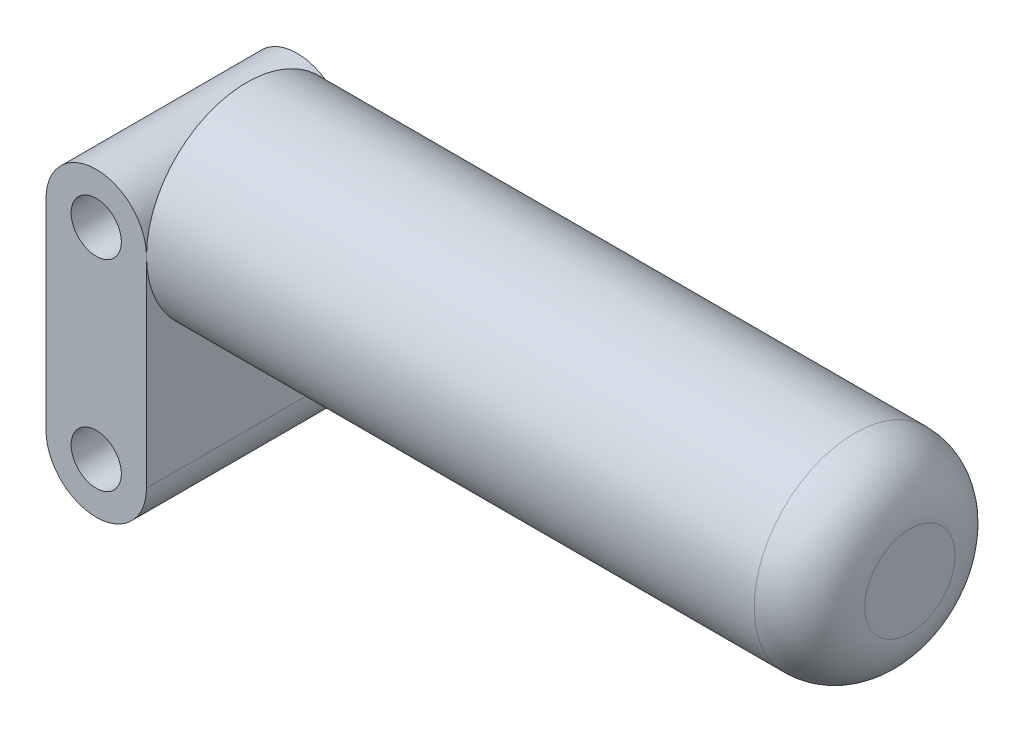
ISO-10303-21;
HEADER;
FILE_DESCRIPTION(('STEP AP214'),'2;1');
FILE_NAME('part.step','',(''),(''),'','','');
FILE_SCHEMA(('AUTOMOTIVE_DESIGN { 1 0 10303 214 1 1 1 1 }'));
ENDSEC;
DATA;
#1=APPLICATION_CONTEXT('core data for automotive mechanical design processes');
#2=APPLICATION_PROTOCOL_DEFINITION('international standard','automotive_design',2000,#1);
#3=PRODUCT_CONTEXT('',#1,'mechanical');
#4=PRODUCT('Part','Part','',(#3));
#5=PRODUCT_RELATED_PRODUCT_CATEGORY('part','',(#4));
#6=PRODUCT_DEFINITION_FORMATION('','',#4);
#7=PRODUCT_DEFINITION_CONTEXT('part definition',#1,'design');
#8=PRODUCT_DEFINITION('design','',#6,#7);
#9=PRODUCT_DEFINITION_SHAPE('','',#8);
#10=(LENGTH_UNIT() NAMED_UNIT(*) SI_UNIT(.MILLI.,.METRE.));
#11=(NAMED_UNIT(*) PLANE_ANGLE_UNIT() SI_UNIT($,.RADIAN.));
#12=(NAMED_UNIT(*) SI_UNIT($,.STERADIAN.) SOLID_ANGLE_UNIT());
#13=UNCERTAINTY_MEASURE_WITH_UNIT(LENGTH_MEASURE(1.E-05),#10,'distance_accuracy_value','');
#14=(GEOMETRIC_REPRESENTATION_CONTEXT(3) GLOBAL_UNCERTAINTY_ASSIGNED_CONTEXT((#13)) GLOBAL_UNIT_ASSIGNED_CONTEXT((#10,
#11,#12)) REPRESENTATION_CONTEXT('',''));
#15=CARTESIAN_POINT('',(0.,0.,0.));
#16=DIRECTION('',(0.,0.,1.));
#17=DIRECTION('',(1.,0.,0.));
#18=AXIS2_PLACEMENT_3D('',#15,#16,#17);
#19=CARTESIAN_POINT('',(0.,10.,10.));
#20=DIRECTION('',(0.,0.,1.));
#21=DIRECTION('',(1.,0.,0.));
#22=AXIS2_PLACEMENT_3D('',#19,#20,#21);
#23=PLANE('',#22);
#24=CARTESIAN_POINT('',(0.,10.,10.));
#25=DIRECTION('',(0.,0.,1.));
#26=DIRECTION('',(1.,0.,0.));
#27=AXIS2_PLACEMENT_3D('',#24,#25,#26);
#28=CIRCLE('',#27,2.5);
#29=CARTESIAN_POINT('',(2.5,10.,10.));
#30=VERTEX_POINT('',#29);
#31=EDGE_CURVE('E94',#30,#30,#28,.T.);
#32=ORIENTED_EDGE('',*,*,#31,.F.);
#33=EDGE_LOOP('',(#32));
#34=FACE_BOUND('',#33,.T.);
#35=CARTESIAN_POINT('',(0.,10.,10.));
#36=DIRECTION('',(0.,0.,1.));
#37=DIRECTION('',(1.,0.,0.));
#38=AXIS2_PLACEMENT_3D('',#35,#36,#37);
#39=CIRCLE('',#38,5.);
#40=CARTESIAN_POINT('',(5.,10.,10.));
#41=VERTEX_POINT('',#40);
#42=CARTESIAN_POINT('',(-5.,10.,10.));
#43=VERTEX_POINT('',#42);
#44=EDGE_CURVE('E100',#41,#43,#39,.T.);
#45=ORIENTED_EDGE('',*,*,#44,.T.);
#46=DIRECTION('',(0.,-1.,0.));
#47=VECTOR('',#46,1.);
#48=CARTESIAN_POINT('',(-5.,10.,10.));
#49=LINE('',#48,#47);
#50=CARTESIAN_POINT('',(-4.99999999999999,-10.,10.));
#51=VERTEX_POINT('',#50);
#52=EDGE_CURVE('E80',#43,#51,#49,.T.);
#53=ORIENTED_EDGE('',*,*,#52,.T.);
#54=CARTESIAN_POINT('',(0.,-10.,10.));
#55=DIRECTION('',(0.,0.,1.));
#56=DIRECTION('',(1.,0.,0.));
#57=AXIS2_PLACEMENT_3D('',#54,#55,#56);
#58=CIRCLE('',#57,5.);
#59=CARTESIAN_POINT('',(5.,-10.,10.));
#60=VERTEX_POINT('',#59);
#61=EDGE_CURVE('E128',#51,#60,#58,.T.);
#62=ORIENTED_EDGE('',*,*,#61,.T.);
#63=DIRECTION('',(0.,1.,0.));
#64=VECTOR('',#63,1.);
#65=CARTESIAN_POINT('',(5.,10.,10.));
#66=LINE('',#65,#64);
#67=EDGE_CURVE('E105',#60,#41,#66,.T.);
#68=ORIENTED_EDGE('',*,*,#67,.T.);
#69=EDGE_LOOP('',(#45,#53,#62,#68));
#70=FACE_BOUND('',#69,.T.);
#71=CARTESIAN_POINT('',(0.,-10.,10.));
#72=DIRECTION('',(0.,0.,1.));
#73=DIRECTION('',(-1.,0.,0.));
#74=AXIS2_PLACEMENT_3D('',#71,#72,#73);
#75=CIRCLE('',#74,2.5);
#76=CARTESIAN_POINT('',(-2.5,-10.,10.));
#77=VERTEX_POINT('',#76);
#78=EDGE_CURVE('E116',#77,#77,#75,.T.);
#79=ORIENTED_EDGE('',*,*,#78,.F.);
#80=EDGE_LOOP('',(#79));
#81=FACE_BOUND('',#80,.T.);
#82=ADVANCED_FACE('F36',(#34,#70,#81),#23,.T.);
#83=CARTESIAN_POINT('',(0.,10.,-10.));
#84=DIRECTION('',(0.,0.,1.));
#85=DIRECTION('',(1.,0.,0.));
#86=AXIS2_PLACEMENT_3D('',#83,#84,#85);
#87=PLANE('',#86);
#88=CARTESIAN_POINT('',(0.,10.,-10.));
#89=DIRECTION('',(0.,0.,1.));
#90=DIRECTION('',(1.,0.,0.));
#91=AXIS2_PLACEMENT_3D('',#88,#89,#90);
#92=CIRCLE('',#91,5.);
#93=CARTESIAN_POINT('',(5.,10.,-10.));
#94=VERTEX_POINT('',#93);
#95=CARTESIAN_POINT('',(-5.,10.,-10.));
#96=VERTEX_POINT('',#95);
#97=EDGE_CURVE('E87',#94,#96,#92,.T.);
#98=ORIENTED_EDGE('',*,*,#97,.F.);
#99=DIRECTION('',(0.,1.,0.));
#100=VECTOR('',#99,1.);
#101=CARTESIAN_POINT('',(5.,10.,-10.));
#102=LINE('',#101,#100);
#103=CARTESIAN_POINT('',(5.,-10.,-10.));
#104=VERTEX_POINT('',#103);
#105=EDGE_CURVE('E91',#104,#94,#102,.T.);
#106=ORIENTED_EDGE('',*,*,#105,.F.);
#107=CARTESIAN_POINT('',(0.,-10.,-10.));
#108=DIRECTION('',(0.,0.,1.));
#109=DIRECTION('',(1.,0.,0.));
#110=AXIS2_PLACEMENT_3D('',#107,#108,#109);
#111=CIRCLE('',#110,5.);
#112=CARTESIAN_POINT('',(-4.99999999999999,-10.,-10.));
#113=VERTEX_POINT('',#112);
#114=EDGE_CURVE('E75',#113,#104,#111,.T.);
#115=ORIENTED_EDGE('',*,*,#114,.F.);
#116=DIRECTION('',(0.,-1.,0.));
#117=VECTOR('',#116,1.);
#118=CARTESIAN_POINT('',(-5.,10.,-10.));
#119=LINE('',#118,#117);
#120=EDGE_CURVE('E68',#96,#113,#119,.T.);
#121=ORIENTED_EDGE('',*,*,#120,.F.);
#122=EDGE_LOOP('',(#98,#106,#115,#121));
#123=FACE_BOUND('',#122,.T.);
#124=CARTESIAN_POINT('',(0.,10.,-10.));
#125=DIRECTION('',(0.,0.,1.));
#126=DIRECTION('',(1.,0.,0.));
#127=AXIS2_PLACEMENT_3D('',#124,#125,#126);
#128=CIRCLE('',#127,2.5);
#129=CARTESIAN_POINT('',(2.5,10.,-10.));
#130=VERTEX_POINT('',#129);
#131=EDGE_CURVE('E120',#130,#130,#128,.T.);
#132=ORIENTED_EDGE('',*,*,#131,.T.);
#133=EDGE_LOOP('',(#132));
#134=FACE_BOUND('',#133,.T.);
#135=CARTESIAN_POINT('',(0.,-10.,-10.));
#136=DIRECTION('',(0.,0.,1.));
#137=DIRECTION('',(-1.,0.,0.));
#138=AXIS2_PLACEMENT_3D('',#135,#136,#137);
#139=CIRCLE('',#138,2.5);
#140=CARTESIAN_POINT('',(-2.5,-10.,-10.));
#141=VERTEX_POINT('',#140);
#142=EDGE_CURVE('E114',#141,#141,#139,.T.);
#143=ORIENTED_EDGE('',*,*,#142,.T.);
#144=EDGE_LOOP('',(#143));
#145=FACE_BOUND('',#144,.T.);
#146=ADVANCED_FACE('F89',(#123,#134,#145),#87,.F.);
#147=CARTESIAN_POINT('',(0.,10.,10.));
#148=DIRECTION('',(0.,0.,-1.));
#149=DIRECTION('',(-1.,0.,0.));
#150=AXIS2_PLACEMENT_3D('',#147,#148,#149);
#151=CYLINDRICAL_SURFACE('',#150,5.);
#152=ORIENTED_EDGE('',*,*,#97,.T.);
#153=DIRECTION('',(0.,0.,-1.));
#154=VECTOR('',#153,1.);
#155=CARTESIAN_POINT('',(-5.,10.,10.));
#156=LINE('',#155,#154);
#157=EDGE_CURVE('E136',#43,#96,#156,.T.);
#158=ORIENTED_EDGE('',*,*,#157,.F.);
#159=ORIENTED_EDGE('',*,*,#44,.F.);
#160=DIRECTION('',(0.,0.,-1.));
#161=VECTOR('',#160,1.);
#162=CARTESIAN_POINT('',(5.,10.,10.));
#163=LINE('',#162,#161);
#164=EDGE_CURVE('E98',#41,#94,#163,.T.);
#165=ORIENTED_EDGE('',*,*,#164,.T.);
#166=EDGE_LOOP('',(#152,#158,#159,#165));
#167=FACE_BOUND('',#166,.T.);
#168=ADVANCED_FACE('F99',(#167),#151,.T.);
#169=CARTESIAN_POINT('',(-5.,10.,10.));
#170=DIRECTION('',(1.,0.,0.));
#171=DIRECTION('',(0.,1.,0.));
#172=AXIS2_PLACEMENT_3D('',#169,#170,#171);
#173=PLANE('',#172);
#174=ORIENTED_EDGE('',*,*,#120,.T.);
#175=DIRECTION('',(0.,0.,-1.));
#176=VECTOR('',#175,1.);
#177=CARTESIAN_POINT('',(-4.99999999999999,-10.,10.));
#178=LINE('',#177,#176);
#179=EDGE_CURVE('E134',#51,#113,#178,.T.);
#180=ORIENTED_EDGE('',*,*,#179,.F.);
#181=ORIENTED_EDGE('',*,*,#52,.F.);
#182=ORIENTED_EDGE('',*,*,#157,.T.);
#183=EDGE_LOOP('',(#174,#180,#181,#182));
#184=FACE_BOUND('',#183,.T.);
#185=ADVANCED_FACE('F167',(#184),#173,.F.);
#186=CARTESIAN_POINT('',(0.,-10.,10.));
#187=DIRECTION('',(0.,0.,-1.));
#188=DIRECTION('',(-1.,0.,0.));
#189=AXIS2_PLACEMENT_3D('',#186,#187,#188);
#190=CYLINDRICAL_SURFACE('',#189,5.);
#191=ORIENTED_EDGE('',*,*,#114,.T.);
#192=DIRECTION('',(0.,0.,-1.));
#193=VECTOR('',#192,1.);
#194=CARTESIAN_POINT('',(5.,-10.,10.));
#195=LINE('',#194,#193);
#196=EDGE_CURVE('E104',#60,#104,#195,.T.);
#197=ORIENTED_EDGE('',*,*,#196,.F.);
#198=ORIENTED_EDGE('',*,*,#61,.F.);
#199=ORIENTED_EDGE('',*,*,#179,.T.);
#200=EDGE_LOOP('',(#191,#197,#198,#199));
#201=FACE_BOUND('',#200,.T.);
#202=ADVANCED_FACE('F164',(#201),#190,.T.);
#203=CARTESIAN_POINT('',(5.,10.,10.));
#204=DIRECTION('',(-1.,0.,0.));
#205=DIRECTION('',(0.,-1.,0.));
#206=AXIS2_PLACEMENT_3D('',#203,#204,#205);
#207=PLANE('',#206);
#208=CARTESIAN_POINT('',(5.,10.,0.));
#209=DIRECTION('',(1.,0.,0.));
#210=DIRECTION('',(0.,1.,0.));
#211=AXIS2_PLACEMENT_3D('',#208,#209,#210);
#212=CIRCLE('',#211,10.);
#213=EDGE_CURVE('E53',#41,#94,#212,.T.);
#214=ORIENTED_EDGE('',*,*,#213,.F.);
#215=ORIENTED_EDGE('',*,*,#67,.F.);
#216=ORIENTED_EDGE('',*,*,#196,.T.);
#217=ORIENTED_EDGE('',*,*,#105,.T.);
#218=EDGE_LOOP('',(#214,#215,#216,#217));
#219=FACE_BOUND('',#218,.T.);
#220=ADVANCED_FACE('F107',(#219),#207,.F.);
#221=CARTESIAN_POINT('',(0.,10.,10.));
#222=DIRECTION('',(0.,0.,-1.));
#223=DIRECTION('',(-1.,0.,0.));
#224=AXIS2_PLACEMENT_3D('',#221,#222,#223);
#225=CYLINDRICAL_SURFACE('',#224,2.5);
#226=ORIENTED_EDGE('',*,*,#31,.T.);
#227=EDGE_LOOP('',(#226));
#228=FACE_BOUND('',#227,.T.);
#229=ORIENTED_EDGE('',*,*,#131,.F.);
#230=EDGE_LOOP('',(#229));
#231=FACE_BOUND('',#230,.T.);
#232=ADVANCED_FACE('F159',(#228,#231),#225,.F.);
#233=CARTESIAN_POINT('',(0.,-10.,10.));
#234=DIRECTION('',(0.,0.,-1.));
#235=DIRECTION('',(-1.,0.,0.));
#236=AXIS2_PLACEMENT_3D('',#233,#234,#235);
#237=CYLINDRICAL_SURFACE('',#236,2.5);
#238=ORIENTED_EDGE('',*,*,#78,.T.);
#239=EDGE_LOOP('',(#238));
#240=FACE_BOUND('',#239,.T.);
#241=ORIENTED_EDGE('',*,*,#142,.F.);
#242=EDGE_LOOP('',(#241));
#243=FACE_BOUND('',#242,.T.);
#244=ADVANCED_FACE('F193',(#240,#243),#237,.F.);
#245=CARTESIAN_POINT('',(71.,10.,0.));
#246=DIRECTION('',(-1.,0.,0.));
#247=DIRECTION('',(0.,-1.,0.));
#248=AXIS2_PLACEMENT_3D('',#245,#246,#247);
#249=CYLINDRICAL_SURFACE('',#248,10.);
#250=CARTESIAN_POINT('',(65.5,10.,0.));
#251=DIRECTION('',(1.,0.,0.));
#252=DIRECTION('',(0.,1.,0.));
#253=AXIS2_PLACEMENT_3D('',#250,#251,#252);
#254=CIRCLE('',#253,10.);
#255=CARTESIAN_POINT('',(65.5,20.,0.));
#256=VERTEX_POINT('',#255);
#257=EDGE_CURVE('E11',#256,#256,#254,.F.);
#258=ORIENTED_EDGE('',*,*,#257,.T.);
#259=EDGE_LOOP('',(#258));
#260=FACE_BOUND('',#259,.T.);
#261=ORIENTED_EDGE('',*,*,#213,.T.);
#262=EDGE_CURVE('E109',#94,#41,#212,.T.);
#263=ORIENTED_EDGE('',*,*,#262,.T.);
#264=EDGE_LOOP('',(#261,#263));
#265=FACE_BOUND('',#264,.T.);
#266=ADVANCED_FACE('F113',(#260,#265),#249,.T.);
#267=CARTESIAN_POINT('',(71.,10.,0.));
#268=DIRECTION('',(1.,0.,0.));
#269=DIRECTION('',(0.,1.,0.));
#270=AXIS2_PLACEMENT_3D('',#267,#268,#269);
#271=PLANE('',#270);
#272=CARTESIAN_POINT('',(71.,10.,0.));
#273=DIRECTION('',(1.,0.,0.));
#274=DIRECTION('',(0.,1.,0.));
#275=AXIS2_PLACEMENT_3D('',#272,#273,#274);
#276=CIRCLE('',#275,4.5);
#277=CARTESIAN_POINT('',(71.,14.5,0.));
#278=VERTEX_POINT('',#277);
#279=EDGE_CURVE('E45',#278,#278,#276,.T.);
#280=ORIENTED_EDGE('',*,*,#279,.T.);
#281=EDGE_LOOP('',(#280));
#282=FACE_BOUND('',#281,.T.);
#283=ADVANCED_FACE('F140',(#282),#271,.T.);
#284=CARTESIAN_POINT('',(5.,10.,0.));
#285=DIRECTION('',(1.,0.,0.));
#286=DIRECTION('',(0.,1.,0.));
#287=AXIS2_PLACEMENT_3D('',#284,#285,#286);
#288=PLANE('',#287);
#289=ORIENTED_EDGE('',*,*,#164,.F.);
#290=ORIENTED_EDGE('',*,*,#262,.F.);
#291=EDGE_LOOP('',(#289,#290));
#292=FACE_BOUND('',#291,.T.);
#293=ADVANCED_FACE('F110',(#292),#288,.F.);
#294=CARTESIAN_POINT('',(65.5,10.,0.));
#295=DIRECTION('',(1.,0.,0.));
#296=DIRECTION('',(0.,1.,0.));
#297=AXIS2_PLACEMENT_3D('',#294,#295,#296);
#298=DEGENERATE_TOROIDAL_SURFACE('',#297,4.5,5.5,.T.);
#299=ORIENTED_EDGE('',*,*,#257,.F.);
#300=EDGE_LOOP('',(#299));
#301=FACE_BOUND('',#300,.T.);
#302=ORIENTED_EDGE('',*,*,#279,.F.);
#303=EDGE_LOOP('',(#302));
#304=FACE_BOUND('',#303,.T.);
#305=ADVANCED_FACE('F38',(#301,#304),#298,.T.);
#306=CLOSED_SHELL('',(#82,#146,#168,#185,#202,#220,#232,#244,#266,#283,#293,#305));
#307=MANIFOLD_SOLID_BREP('B2',#306);
#308=ADVANCED_BREP_SHAPE_REPRESENTATION('',(#18,#307),#14);
#309=SHAPE_DEFINITION_REPRESENTATION(#9,#308);
ENDSEC;
END-ISO-10303-21;
